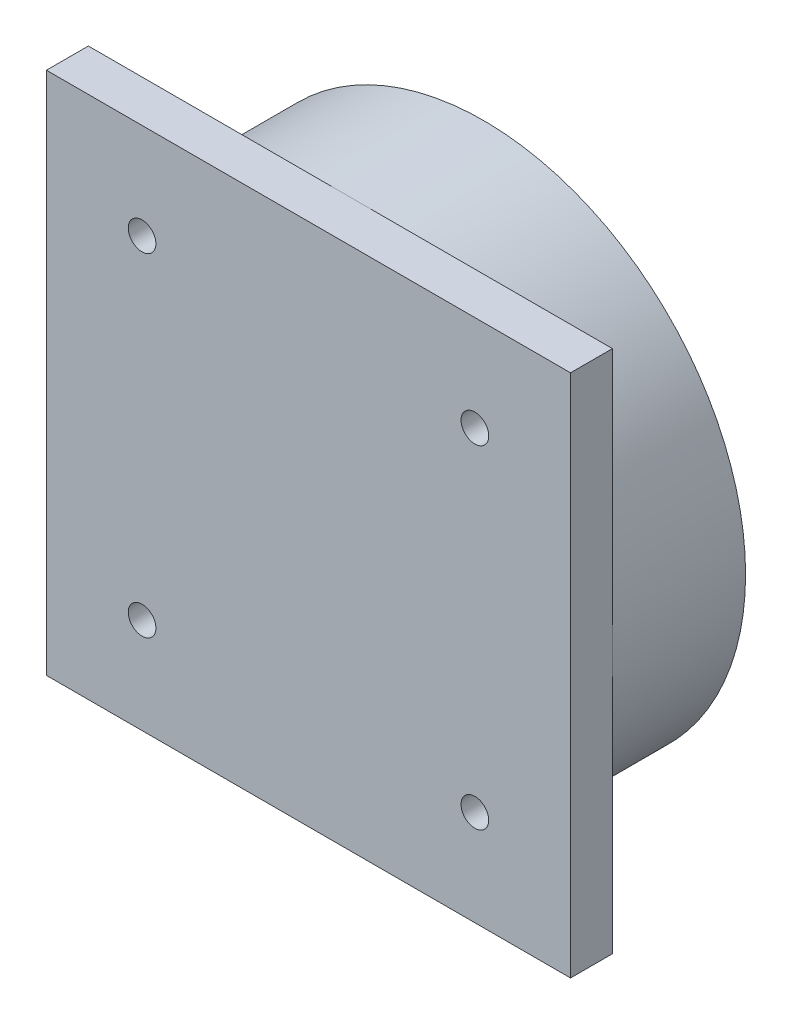
ISO-10303-21;
HEADER;
FILE_DESCRIPTION(('STEP AP214'),'2;1');
FILE_NAME('part.step','',(''),(''),'','','');
FILE_SCHEMA(('AUTOMOTIVE_DESIGN { 1 0 10303 214 1 1 1 1 }'));
ENDSEC;
DATA;
#1=APPLICATION_CONTEXT('core data for automotive mechanical design processes');
#2=APPLICATION_PROTOCOL_DEFINITION('international standard','automotive_design',2000,#1);
#3=PRODUCT_CONTEXT('',#1,'mechanical');
#4=PRODUCT('Part','Part','',(#3));
#5=PRODUCT_RELATED_PRODUCT_CATEGORY('part','',(#4));
#6=PRODUCT_DEFINITION_FORMATION('','',#4);
#7=PRODUCT_DEFINITION_CONTEXT('part definition',#1,'design');
#8=PRODUCT_DEFINITION('design','',#6,#7);
#9=PRODUCT_DEFINITION_SHAPE('','',#8);
#10=(LENGTH_UNIT() NAMED_UNIT(*) SI_UNIT(.MILLI.,.METRE.));
#11=(NAMED_UNIT(*) PLANE_ANGLE_UNIT() SI_UNIT($,.RADIAN.));
#12=(NAMED_UNIT(*) SI_UNIT($,.STERADIAN.) SOLID_ANGLE_UNIT());
#13=UNCERTAINTY_MEASURE_WITH_UNIT(LENGTH_MEASURE(1.E-05),#10,'distance_accuracy_value','');
#14=(GEOMETRIC_REPRESENTATION_CONTEXT(3) GLOBAL_UNCERTAINTY_ASSIGNED_CONTEXT((#13)) GLOBAL_UNIT_ASSIGNED_CONTEXT((#10,
#11,#12)) REPRESENTATION_CONTEXT('',''));
#15=CARTESIAN_POINT('',(0.,0.,0.));
#16=DIRECTION('',(0.,0.,1.));
#17=DIRECTION('',(1.,0.,0.));
#18=AXIS2_PLACEMENT_3D('',#15,#16,#17);
#19=CARTESIAN_POINT('',(0.,0.,12.7));
#20=DIRECTION('',(0.,0.,-1.));
#21=DIRECTION('',(-1.,0.,0.));
#22=AXIS2_PLACEMENT_3D('',#19,#20,#21);
#23=CYLINDRICAL_SURFACE('',#22,25.);
#24=CARTESIAN_POINT('',(0.,0.,12.7));
#25=DIRECTION('',(0.,0.,1.));
#26=DIRECTION('',(1.,0.,0.));
#27=AXIS2_PLACEMENT_3D('',#24,#25,#26);
#28=CIRCLE('',#27,25.);
#29=CARTESIAN_POINT('',(25.,0.,12.7));
#30=VERTEX_POINT('',#29);
#31=CARTESIAN_POINT('',(0.,25.,12.7));
#32=VERTEX_POINT('',#31);
#33=EDGE_CURVE('E11',#30,#32,#28,.T.);
#34=ORIENTED_EDGE('',*,*,#33,.F.);
#35=CARTESIAN_POINT('',(0.,-25.,12.7));
#36=VERTEX_POINT('',#35);
#37=EDGE_CURVE('E42',#36,#30,#28,.T.);
#38=ORIENTED_EDGE('',*,*,#37,.F.);
#39=CARTESIAN_POINT('',(-25.,0.,12.7));
#40=VERTEX_POINT('',#39);
#41=EDGE_CURVE('E52',#40,#36,#28,.T.);
#42=ORIENTED_EDGE('',*,*,#41,.F.);
#43=EDGE_CURVE('E41',#32,#40,#28,.T.);
#44=ORIENTED_EDGE('',*,*,#43,.F.);
#45=EDGE_LOOP('',(#34,#38,#42,#44));
#46=FACE_BOUND('',#45,.T.);
#47=CARTESIAN_POINT('',(0.,0.,0.));
#48=DIRECTION('',(0.,0.,1.));
#49=DIRECTION('',(1.,0.,0.));
#50=AXIS2_PLACEMENT_3D('',#47,#48,#49);
#51=CIRCLE('',#50,25.);
#52=CARTESIAN_POINT('',(25.,0.,0.));
#53=VERTEX_POINT('',#52);
#54=EDGE_CURVE('E36',#53,#53,#51,.T.);
#55=ORIENTED_EDGE('',*,*,#54,.T.);
#56=EDGE_LOOP('',(#55));
#57=FACE_BOUND('',#56,.T.);
#58=ADVANCED_FACE('F33',(#46,#57),#23,.T.);
#59=CARTESIAN_POINT('',(0.,0.,0.));
#60=DIRECTION('',(0.,0.,1.));
#61=DIRECTION('',(1.,0.,0.));
#62=AXIS2_PLACEMENT_3D('',#59,#60,#61);
#63=PLANE('',#62);
#64=CARTESIAN_POINT('',(-15.875,-15.875,0.));
#65=DIRECTION('',(0.,0.,1.));
#66=DIRECTION('',(1.,0.,0.));
#67=AXIS2_PLACEMENT_3D('',#64,#65,#66);
#68=CIRCLE('',#67,1.32);
#69=CARTESIAN_POINT('',(-14.555,-15.875,0.));
#70=VERTEX_POINT('',#69);
#71=EDGE_CURVE('E150',#70,#70,#68,.T.);
#72=ORIENTED_EDGE('',*,*,#71,.T.);
#73=EDGE_LOOP('',(#72));
#74=FACE_BOUND('',#73,.T.);
#75=CARTESIAN_POINT('',(15.875,-15.875,0.));
#76=DIRECTION('',(0.,0.,1.));
#77=DIRECTION('',(1.,0.,0.));
#78=AXIS2_PLACEMENT_3D('',#75,#76,#77);
#79=CIRCLE('',#78,1.32);
#80=CARTESIAN_POINT('',(17.195,-15.875,0.));
#81=VERTEX_POINT('',#80);
#82=EDGE_CURVE('E144',#81,#81,#79,.T.);
#83=ORIENTED_EDGE('',*,*,#82,.T.);
#84=EDGE_LOOP('',(#83));
#85=FACE_BOUND('',#84,.T.);
#86=CARTESIAN_POINT('',(15.875,15.875,0.));
#87=DIRECTION('',(0.,0.,1.));
#88=DIRECTION('',(1.,0.,0.));
#89=AXIS2_PLACEMENT_3D('',#86,#87,#88);
#90=CIRCLE('',#89,1.32);
#91=CARTESIAN_POINT('',(17.195,15.875,0.));
#92=VERTEX_POINT('',#91);
#93=EDGE_CURVE('E138',#92,#92,#90,.T.);
#94=ORIENTED_EDGE('',*,*,#93,.T.);
#95=EDGE_LOOP('',(#94));
#96=FACE_BOUND('',#95,.T.);
#97=CARTESIAN_POINT('',(-15.875,15.875,0.));
#98=DIRECTION('',(0.,0.,1.));
#99=DIRECTION('',(1.,0.,0.));
#100=AXIS2_PLACEMENT_3D('',#97,#98,#99);
#101=CIRCLE('',#100,1.32);
#102=CARTESIAN_POINT('',(-14.555,15.875,0.));
#103=VERTEX_POINT('',#102);
#104=EDGE_CURVE('E137',#103,#103,#101,.T.);
#105=ORIENTED_EDGE('',*,*,#104,.T.);
#106=EDGE_LOOP('',(#105));
#107=FACE_BOUND('',#106,.T.);
#108=ORIENTED_EDGE('',*,*,#54,.F.);
#109=EDGE_LOOP('',(#108));
#110=FACE_BOUND('',#109,.T.);
#111=ADVANCED_FACE('F159',(#74,#85,#96,#107,#110),#63,.F.);
#112=CARTESIAN_POINT('',(0.,0.,12.7));
#113=DIRECTION('',(0.,0.,1.));
#114=DIRECTION('',(1.,0.,0.));
#115=AXIS2_PLACEMENT_3D('',#112,#113,#114);
#116=PLANE('',#115);
#117=DIRECTION('',(0.,1.,0.));
#118=VECTOR('',#117,1.);
#119=CARTESIAN_POINT('',(25.,25.,12.7));
#120=LINE('',#119,#118);
#121=CARTESIAN_POINT('',(25.,25.,12.7));
#122=VERTEX_POINT('',#121);
#123=EDGE_CURVE('E126',#30,#122,#120,.T.);
#124=ORIENTED_EDGE('',*,*,#123,.F.);
#125=ORIENTED_EDGE('',*,*,#33,.T.);
#126=DIRECTION('',(-1.,0.,0.));
#127=VECTOR('',#126,1.);
#128=CARTESIAN_POINT('',(-25.,25.,12.7));
#129=LINE('',#128,#127);
#130=EDGE_CURVE('E104',#122,#32,#129,.T.);
#131=ORIENTED_EDGE('',*,*,#130,.F.);
#132=EDGE_LOOP('',(#124,#125,#131));
#133=FACE_BOUND('',#132,.T.);
#134=ADVANCED_FACE('F194',(#133),#116,.F.);
#135=CARTESIAN_POINT('',(-25.,25.,12.7));
#136=VERTEX_POINT('',#135);
#137=EDGE_CURVE('E122',#32,#136,#129,.T.);
#138=ORIENTED_EDGE('',*,*,#137,.F.);
#139=ORIENTED_EDGE('',*,*,#43,.T.);
#140=DIRECTION('',(0.,-1.,0.));
#141=VECTOR('',#140,1.);
#142=CARTESIAN_POINT('',(-25.,25.,12.7));
#143=LINE('',#142,#141);
#144=EDGE_CURVE('E130',#136,#40,#143,.T.);
#145=ORIENTED_EDGE('',*,*,#144,.F.);
#146=EDGE_LOOP('',(#138,#139,#145));
#147=FACE_BOUND('',#146,.T.);
#148=ADVANCED_FACE('F212',(#147),#116,.F.);
#149=CARTESIAN_POINT('',(-25.,-25.,12.7));
#150=VERTEX_POINT('',#149);
#151=EDGE_CURVE('E109',#40,#150,#143,.T.);
#152=ORIENTED_EDGE('',*,*,#151,.F.);
#153=ORIENTED_EDGE('',*,*,#41,.T.);
#154=DIRECTION('',(1.,0.,0.));
#155=VECTOR('',#154,1.);
#156=CARTESIAN_POINT('',(-25.,-25.,12.7));
#157=LINE('',#156,#155);
#158=EDGE_CURVE('E127',#150,#36,#157,.T.);
#159=ORIENTED_EDGE('',*,*,#158,.F.);
#160=EDGE_LOOP('',(#152,#153,#159));
#161=FACE_BOUND('',#160,.T.);
#162=ADVANCED_FACE('F214',(#161),#116,.F.);
#163=CARTESIAN_POINT('',(25.,-25.,12.7));
#164=VERTEX_POINT('',#163);
#165=EDGE_CURVE('E129',#36,#164,#157,.T.);
#166=ORIENTED_EDGE('',*,*,#165,.F.);
#167=ORIENTED_EDGE('',*,*,#37,.T.);
#168=EDGE_CURVE('E123',#164,#30,#120,.T.);
#169=ORIENTED_EDGE('',*,*,#168,.F.);
#170=EDGE_LOOP('',(#166,#167,#169));
#171=FACE_BOUND('',#170,.T.);
#172=ADVANCED_FACE('F205',(#171),#116,.F.);
#173=CARTESIAN_POINT('',(-25.,25.,16.7));
#174=DIRECTION('',(1.,0.,0.));
#175=DIRECTION('',(0.,1.,0.));
#176=AXIS2_PLACEMENT_3D('',#173,#174,#175);
#177=PLANE('',#176);
#178=ORIENTED_EDGE('',*,*,#144,.T.);
#179=ORIENTED_EDGE('',*,*,#151,.T.);
#180=DIRECTION('',(0.,0.,-1.));
#181=VECTOR('',#180,1.);
#182=CARTESIAN_POINT('',(-25.,-25.,16.7));
#183=LINE('',#182,#181);
#184=CARTESIAN_POINT('',(-25.,-25.,16.7));
#185=VERTEX_POINT('',#184);
#186=EDGE_CURVE('E89',#185,#150,#183,.T.);
#187=ORIENTED_EDGE('',*,*,#186,.F.);
#188=DIRECTION('',(0.,-1.,0.));
#189=VECTOR('',#188,1.);
#190=CARTESIAN_POINT('',(-25.,25.,16.7));
#191=LINE('',#190,#189);
#192=CARTESIAN_POINT('',(-25.,25.,16.7));
#193=VERTEX_POINT('',#192);
#194=EDGE_CURVE('E95',#193,#185,#191,.T.);
#195=ORIENTED_EDGE('',*,*,#194,.F.);
#196=DIRECTION('',(0.,0.,-1.));
#197=VECTOR('',#196,1.);
#198=CARTESIAN_POINT('',(-25.,25.,16.7));
#199=LINE('',#198,#197);
#200=EDGE_CURVE('E118',#193,#136,#199,.T.);
#201=ORIENTED_EDGE('',*,*,#200,.T.);
#202=EDGE_LOOP('',(#178,#179,#187,#195,#201));
#203=FACE_BOUND('',#202,.T.);
#204=ADVANCED_FACE('F107',(#203),#177,.F.);
#205=CARTESIAN_POINT('',(-25.,-25.,16.7));
#206=DIRECTION('',(0.,1.,0.));
#207=DIRECTION('',(-1.,0.,0.));
#208=AXIS2_PLACEMENT_3D('',#205,#206,#207);
#209=PLANE('',#208);
#210=ORIENTED_EDGE('',*,*,#158,.T.);
#211=ORIENTED_EDGE('',*,*,#165,.T.);
#212=DIRECTION('',(0.,0.,-1.));
#213=VECTOR('',#212,1.);
#214=CARTESIAN_POINT('',(25.,-25.,16.7));
#215=LINE('',#214,#213);
#216=CARTESIAN_POINT('',(25.,-25.,16.7));
#217=VERTEX_POINT('',#216);
#218=EDGE_CURVE('E91',#217,#164,#215,.T.);
#219=ORIENTED_EDGE('',*,*,#218,.F.);
#220=DIRECTION('',(1.,0.,0.));
#221=VECTOR('',#220,1.);
#222=CARTESIAN_POINT('',(-25.,-25.,16.7));
#223=LINE('',#222,#221);
#224=EDGE_CURVE('E84',#185,#217,#223,.T.);
#225=ORIENTED_EDGE('',*,*,#224,.F.);
#226=ORIENTED_EDGE('',*,*,#186,.T.);
#227=EDGE_LOOP('',(#210,#211,#219,#225,#226));
#228=FACE_BOUND('',#227,.T.);
#229=ADVANCED_FACE('F87',(#228),#209,.F.);
#230=CARTESIAN_POINT('',(25.,25.,16.7));
#231=DIRECTION('',(-1.,0.,0.));
#232=DIRECTION('',(0.,-1.,0.));
#233=AXIS2_PLACEMENT_3D('',#230,#231,#232);
#234=PLANE('',#233);
#235=ORIENTED_EDGE('',*,*,#168,.T.);
#236=ORIENTED_EDGE('',*,*,#123,.T.);
#237=DIRECTION('',(0.,0.,-1.));
#238=VECTOR('',#237,1.);
#239=CARTESIAN_POINT('',(25.,25.,16.7));
#240=LINE('',#239,#238);
#241=CARTESIAN_POINT('',(25.,25.,16.7));
#242=VERTEX_POINT('',#241);
#243=EDGE_CURVE('E113',#242,#122,#240,.T.);
#244=ORIENTED_EDGE('',*,*,#243,.F.);
#245=DIRECTION('',(0.,1.,0.));
#246=VECTOR('',#245,1.);
#247=CARTESIAN_POINT('',(25.,25.,16.7));
#248=LINE('',#247,#246);
#249=EDGE_CURVE('E94',#217,#242,#248,.T.);
#250=ORIENTED_EDGE('',*,*,#249,.F.);
#251=ORIENTED_EDGE('',*,*,#218,.T.);
#252=EDGE_LOOP('',(#235,#236,#244,#250,#251));
#253=FACE_BOUND('',#252,.T.);
#254=ADVANCED_FACE('F208',(#253),#234,.F.);
#255=CARTESIAN_POINT('',(-25.,25.,16.7));
#256=DIRECTION('',(0.,-1.,0.));
#257=DIRECTION('',(0.,0.,-1.));
#258=AXIS2_PLACEMENT_3D('',#255,#256,#257);
#259=PLANE('',#258);
#260=ORIENTED_EDGE('',*,*,#130,.T.);
#261=ORIENTED_EDGE('',*,*,#137,.T.);
#262=ORIENTED_EDGE('',*,*,#200,.F.);
#263=DIRECTION('',(-1.,0.,0.));
#264=VECTOR('',#263,1.);
#265=CARTESIAN_POINT('',(-25.,25.,16.7));
#266=LINE('',#265,#264);
#267=EDGE_CURVE('E100',#242,#193,#266,.T.);
#268=ORIENTED_EDGE('',*,*,#267,.F.);
#269=ORIENTED_EDGE('',*,*,#243,.T.);
#270=EDGE_LOOP('',(#260,#261,#262,#268,#269));
#271=FACE_BOUND('',#270,.T.);
#272=ADVANCED_FACE('F172',(#271),#259,.F.);
#273=CARTESIAN_POINT('',(0.,0.,16.7));
#274=DIRECTION('',(0.,0.,1.));
#275=DIRECTION('',(1.,0.,0.));
#276=AXIS2_PLACEMENT_3D('',#273,#274,#275);
#277=PLANE('',#276);
#278=CARTESIAN_POINT('',(-15.875,-15.875,16.7));
#279=DIRECTION('',(0.,0.,1.));
#280=DIRECTION('',(1.,0.,0.));
#281=AXIS2_PLACEMENT_3D('',#278,#279,#280);
#282=CIRCLE('',#281,1.32);
#283=CARTESIAN_POINT('',(-14.555,-15.875,16.7));
#284=VERTEX_POINT('',#283);
#285=EDGE_CURVE('E153',#284,#284,#282,.T.);
#286=ORIENTED_EDGE('',*,*,#285,.F.);
#287=EDGE_LOOP('',(#286));
#288=FACE_BOUND('',#287,.T.);
#289=CARTESIAN_POINT('',(15.875,-15.875,16.7));
#290=DIRECTION('',(0.,0.,1.));
#291=DIRECTION('',(1.,0.,0.));
#292=AXIS2_PLACEMENT_3D('',#289,#290,#291);
#293=CIRCLE('',#292,1.32);
#294=CARTESIAN_POINT('',(17.195,-15.875,16.7));
#295=VERTEX_POINT('',#294);
#296=EDGE_CURVE('E147',#295,#295,#293,.T.);
#297=ORIENTED_EDGE('',*,*,#296,.F.);
#298=EDGE_LOOP('',(#297));
#299=FACE_BOUND('',#298,.T.);
#300=CARTESIAN_POINT('',(15.875,15.875,16.7));
#301=DIRECTION('',(0.,0.,1.));
#302=DIRECTION('',(1.,0.,0.));
#303=AXIS2_PLACEMENT_3D('',#300,#301,#302);
#304=CIRCLE('',#303,1.32);
#305=CARTESIAN_POINT('',(17.195,15.875,16.7));
#306=VERTEX_POINT('',#305);
#307=EDGE_CURVE('E141',#306,#306,#304,.T.);
#308=ORIENTED_EDGE('',*,*,#307,.F.);
#309=EDGE_LOOP('',(#308));
#310=FACE_BOUND('',#309,.T.);
#311=CARTESIAN_POINT('',(-15.875,15.875,16.7));
#312=DIRECTION('',(0.,0.,1.));
#313=DIRECTION('',(1.,0.,0.));
#314=AXIS2_PLACEMENT_3D('',#311,#312,#313);
#315=CIRCLE('',#314,1.32);
#316=CARTESIAN_POINT('',(-14.555,15.875,16.7));
#317=VERTEX_POINT('',#316);
#318=EDGE_CURVE('E134',#317,#317,#315,.T.);
#319=ORIENTED_EDGE('',*,*,#318,.F.);
#320=EDGE_LOOP('',(#319));
#321=FACE_BOUND('',#320,.T.);
#322=ORIENTED_EDGE('',*,*,#194,.T.);
#323=ORIENTED_EDGE('',*,*,#224,.T.);
#324=ORIENTED_EDGE('',*,*,#249,.T.);
#325=ORIENTED_EDGE('',*,*,#267,.T.);
#326=EDGE_LOOP('',(#322,#323,#324,#325));
#327=FACE_BOUND('',#326,.T.);
#328=ADVANCED_FACE('F98',(#288,#299,#310,#321,#327),#277,.T.);
#329=CARTESIAN_POINT('',(-15.875,15.875,0.));
#330=DIRECTION('',(0.,0.,1.));
#331=DIRECTION('',(1.,0.,0.));
#332=AXIS2_PLACEMENT_3D('',#329,#330,#331);
#333=CYLINDRICAL_SURFACE('',#332,1.32);
#334=ORIENTED_EDGE('',*,*,#104,.F.);
#335=EDGE_LOOP('',(#334));
#336=FACE_BOUND('',#335,.T.);
#337=ORIENTED_EDGE('',*,*,#318,.T.);
#338=EDGE_LOOP('',(#337));
#339=FACE_BOUND('',#338,.T.);
#340=ADVANCED_FACE('F171',(#336,#339),#333,.F.);
#341=CARTESIAN_POINT('',(15.875,15.875,0.));
#342=DIRECTION('',(0.,0.,1.));
#343=DIRECTION('',(1.,0.,0.));
#344=AXIS2_PLACEMENT_3D('',#341,#342,#343);
#345=CYLINDRICAL_SURFACE('',#344,1.32);
#346=ORIENTED_EDGE('',*,*,#93,.F.);
#347=EDGE_LOOP('',(#346));
#348=FACE_BOUND('',#347,.T.);
#349=ORIENTED_EDGE('',*,*,#307,.T.);
#350=EDGE_LOOP('',(#349));
#351=FACE_BOUND('',#350,.T.);
#352=ADVANCED_FACE('F181',(#348,#351),#345,.F.);
#353=CARTESIAN_POINT('',(15.875,-15.875,0.));
#354=DIRECTION('',(0.,0.,1.));
#355=DIRECTION('',(1.,0.,0.));
#356=AXIS2_PLACEMENT_3D('',#353,#354,#355);
#357=CYLINDRICAL_SURFACE('',#356,1.32);
#358=ORIENTED_EDGE('',*,*,#82,.F.);
#359=EDGE_LOOP('',(#358));
#360=FACE_BOUND('',#359,.T.);
#361=ORIENTED_EDGE('',*,*,#296,.T.);
#362=EDGE_LOOP('',(#361));
#363=FACE_BOUND('',#362,.T.);
#364=ADVANCED_FACE('F165',(#360,#363),#357,.F.);
#365=CARTESIAN_POINT('',(-15.875,-15.875,0.));
#366=DIRECTION('',(0.,0.,1.));
#367=DIRECTION('',(1.,0.,0.));
#368=AXIS2_PLACEMENT_3D('',#365,#366,#367);
#369=CYLINDRICAL_SURFACE('',#368,1.32);
#370=ORIENTED_EDGE('',*,*,#71,.F.);
#371=EDGE_LOOP('',(#370));
#372=FACE_BOUND('',#371,.T.);
#373=ORIENTED_EDGE('',*,*,#285,.T.);
#374=EDGE_LOOP('',(#373));
#375=FACE_BOUND('',#374,.T.);
#376=ADVANCED_FACE('F162',(#372,#375),#369,.F.);
#377=CLOSED_SHELL('',(#58,#111,#134,#148,#162,#172,#204,#229,#254,#272,#328,#340,#352,#364,#376));
#378=MANIFOLD_SOLID_BREP('B2',#377);
#379=ADVANCED_BREP_SHAPE_REPRESENTATION('',(#18,#378),#14);
#380=SHAPE_DEFINITION_REPRESENTATION(#9,#379);
ENDSEC;
END-ISO-10303-21;
